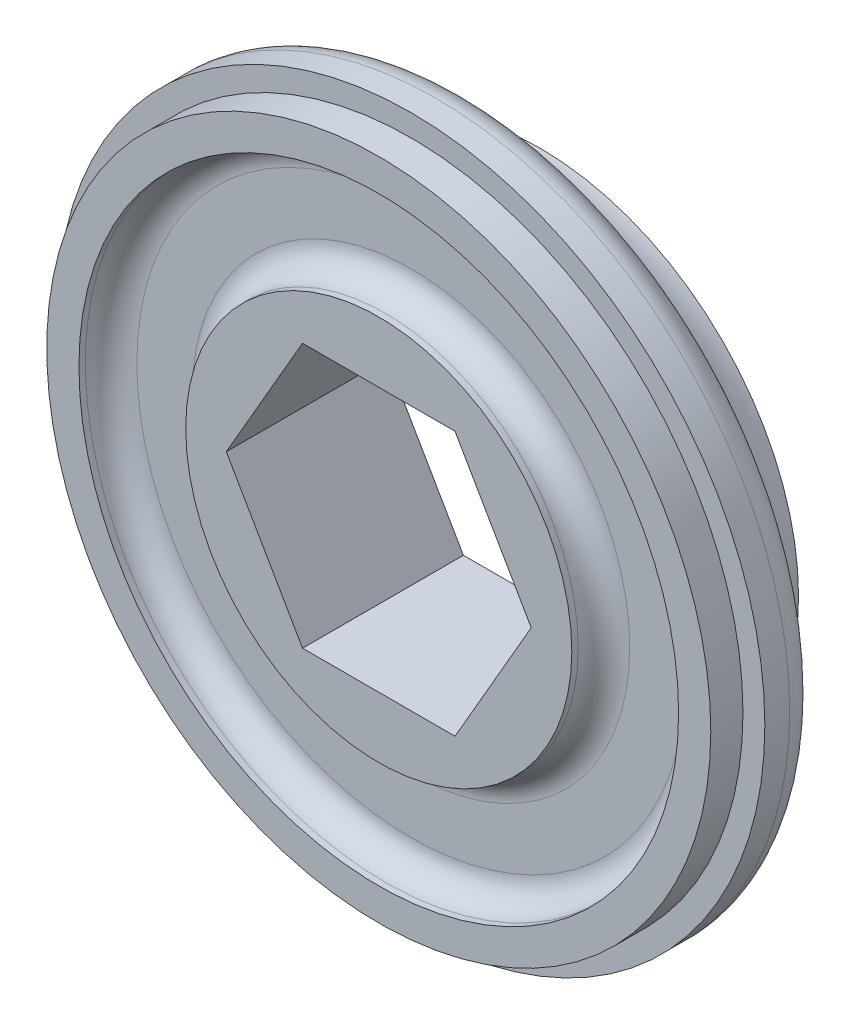
ISO-10303-21;
HEADER;
FILE_DESCRIPTION(('STEP AP214'),'2;1');
FILE_NAME('part.step','',(''),(''),'','','');
FILE_SCHEMA(('AUTOMOTIVE_DESIGN { 1 0 10303 214 1 1 1 1 }'));
ENDSEC;
DATA;
#1=APPLICATION_CONTEXT('core data for automotive mechanical design processes');
#2=APPLICATION_PROTOCOL_DEFINITION('international standard','automotive_design',2000,#1);
#3=PRODUCT_CONTEXT('',#1,'mechanical');
#4=PRODUCT('Part','Part','',(#3));
#5=PRODUCT_RELATED_PRODUCT_CATEGORY('part','',(#4));
#6=PRODUCT_DEFINITION_FORMATION('','',#4);
#7=PRODUCT_DEFINITION_CONTEXT('part definition',#1,'design');
#8=PRODUCT_DEFINITION('design','',#6,#7);
#9=PRODUCT_DEFINITION_SHAPE('','',#8);
#10=(LENGTH_UNIT() NAMED_UNIT(*) SI_UNIT(.MILLI.,.METRE.));
#11=(NAMED_UNIT(*) PLANE_ANGLE_UNIT() SI_UNIT($,.RADIAN.));
#12=(NAMED_UNIT(*) SI_UNIT($,.STERADIAN.) SOLID_ANGLE_UNIT());
#13=UNCERTAINTY_MEASURE_WITH_UNIT(LENGTH_MEASURE(1.E-05),#10,'distance_accuracy_value','');
#14=(GEOMETRIC_REPRESENTATION_CONTEXT(3) GLOBAL_UNCERTAINTY_ASSIGNED_CONTEXT((#13)) GLOBAL_UNIT_ASSIGNED_CONTEXT((#10,
#11,#12)) REPRESENTATION_CONTEXT('',''));
#15=CARTESIAN_POINT('',(0.,0.,0.));
#16=DIRECTION('',(0.,0.,1.));
#17=DIRECTION('',(1.,0.,0.));
#18=AXIS2_PLACEMENT_3D('',#15,#16,#17);
#19=CARTESIAN_POINT('',(-3.76149473879733,6.5151,15.875));
#20=DIRECTION('',(0.866025403784439,-0.5,0.));
#21=DIRECTION('',(0.5,0.866025403784439,0.));
#22=AXIS2_PLACEMENT_3D('',#19,#20,#21);
#23=PLANE('',#22);
#24=DIRECTION('',(0.,0.,-1.));
#25=VECTOR('',#24,1.);
#26=CARTESIAN_POINT('',(-7.52298947759466,0.,15.875));
#27=LINE('',#26,#25);
#28=CARTESIAN_POINT('',(-7.52298947759466,0.,15.875));
#29=VERTEX_POINT('',#28);
#30=CARTESIAN_POINT('',(-7.52298947759466,0.,7.9375));
#31=VERTEX_POINT('',#30);
#32=EDGE_CURVE('E97',#29,#31,#27,.T.);
#33=ORIENTED_EDGE('',*,*,#32,.T.);
#34=DIRECTION('',(0.5,0.866025403784439,0.));
#35=VECTOR('',#34,1.);
#36=CARTESIAN_POINT('',(-3.76149473879733,6.5151,7.9375));
#37=LINE('',#36,#35);
#38=CARTESIAN_POINT('',(-3.76149473879733,6.5151,7.9375));
#39=VERTEX_POINT('',#38);
#40=EDGE_CURVE('E87',#31,#39,#37,.T.);
#41=ORIENTED_EDGE('',*,*,#40,.T.);
#42=DIRECTION('',(0.,0.,-1.));
#43=VECTOR('',#42,1.);
#44=CARTESIAN_POINT('',(-3.76149473879733,6.5151,15.875));
#45=LINE('',#44,#43);
#46=CARTESIAN_POINT('',(-3.76149473879733,6.5151,15.875));
#47=VERTEX_POINT('',#46);
#48=EDGE_CURVE('E94',#47,#39,#45,.T.);
#49=ORIENTED_EDGE('',*,*,#48,.F.);
#50=DIRECTION('',(-0.5,-0.866025403784439,0.));
#51=VECTOR('',#50,1.);
#52=CARTESIAN_POINT('',(-3.76149473879733,6.5151,15.875));
#53=LINE('',#52,#51);
#54=EDGE_CURVE('E124',#47,#29,#53,.T.);
#55=ORIENTED_EDGE('',*,*,#54,.T.);
#56=EDGE_LOOP('',(#33,#41,#49,#55));
#57=FACE_BOUND('',#56,.T.);
#58=ADVANCED_FACE('F32',(#57),#23,.T.);
#59=CARTESIAN_POINT('',(-7.52298947759466,0.,15.875));
#60=DIRECTION('',(0.866025403784439,0.5,0.));
#61=DIRECTION('',(-0.5,0.866025403784439,0.));
#62=AXIS2_PLACEMENT_3D('',#59,#60,#61);
#63=PLANE('',#62);
#64=DIRECTION('',(0.,0.,-1.));
#65=VECTOR('',#64,1.);
#66=CARTESIAN_POINT('',(-3.76149473879733,-6.5151,15.875));
#67=LINE('',#66,#65);
#68=CARTESIAN_POINT('',(-3.76149473879733,-6.5151,15.875));
#69=VERTEX_POINT('',#68);
#70=CARTESIAN_POINT('',(-3.76149473879733,-6.5151,7.9375));
#71=VERTEX_POINT('',#70);
#72=EDGE_CURVE('E116',#69,#71,#67,.T.);
#73=ORIENTED_EDGE('',*,*,#72,.T.);
#74=DIRECTION('',(-0.5,0.866025403784439,0.));
#75=VECTOR('',#74,1.);
#76=CARTESIAN_POINT('',(-7.52298947759466,0.,7.9375));
#77=LINE('',#76,#75);
#78=EDGE_CURVE('E99',#71,#31,#77,.T.);
#79=ORIENTED_EDGE('',*,*,#78,.T.);
#80=ORIENTED_EDGE('',*,*,#32,.F.);
#81=DIRECTION('',(0.5,-0.866025403784439,0.));
#82=VECTOR('',#81,1.);
#83=CARTESIAN_POINT('',(-7.52298947759466,0.,15.875));
#84=LINE('',#83,#82);
#85=EDGE_CURVE('E212',#29,#69,#84,.T.);
#86=ORIENTED_EDGE('',*,*,#85,.T.);
#87=EDGE_LOOP('',(#73,#79,#80,#86));
#88=FACE_BOUND('',#87,.T.);
#89=ADVANCED_FACE('F173',(#88),#63,.T.);
#90=CARTESIAN_POINT('',(-3.76149473879733,-6.5151,15.875));
#91=DIRECTION('',(0.,1.,0.));
#92=DIRECTION('',(-1.,0.,0.));
#93=AXIS2_PLACEMENT_3D('',#90,#91,#92);
#94=PLANE('',#93);
#95=DIRECTION('',(0.,0.,-1.));
#96=VECTOR('',#95,1.);
#97=CARTESIAN_POINT('',(3.76149473879733,-6.5151,15.875));
#98=LINE('',#97,#96);
#99=CARTESIAN_POINT('',(3.76149473879733,-6.5151,15.875));
#100=VERTEX_POINT('',#99);
#101=CARTESIAN_POINT('',(3.76149473879733,-6.5151,7.9375));
#102=VERTEX_POINT('',#101);
#103=EDGE_CURVE('E113',#100,#102,#98,.T.);
#104=ORIENTED_EDGE('',*,*,#103,.T.);
#105=DIRECTION('',(-1.,0.,0.));
#106=VECTOR('',#105,1.);
#107=CARTESIAN_POINT('',(-3.76149473879733,-6.5151,7.9375));
#108=LINE('',#107,#106);
#109=EDGE_CURVE('E228',#102,#71,#108,.T.);
#110=ORIENTED_EDGE('',*,*,#109,.T.);
#111=ORIENTED_EDGE('',*,*,#72,.F.);
#112=DIRECTION('',(1.,0.,0.));
#113=VECTOR('',#112,1.);
#114=CARTESIAN_POINT('',(-3.76149473879733,-6.5151,15.875));
#115=LINE('',#114,#113);
#116=EDGE_CURVE('E214',#69,#100,#115,.T.);
#117=ORIENTED_EDGE('',*,*,#116,.T.);
#118=EDGE_LOOP('',(#104,#110,#111,#117));
#119=FACE_BOUND('',#118,.T.);
#120=ADVANCED_FACE('F178',(#119),#94,.T.);
#121=CARTESIAN_POINT('',(3.76149473879733,-6.5151,15.875));
#122=DIRECTION('',(-0.866025403784439,0.5,0.));
#123=DIRECTION('',(-0.5,-0.866025403784439,0.));
#124=AXIS2_PLACEMENT_3D('',#121,#122,#123);
#125=PLANE('',#124);
#126=DIRECTION('',(0.,0.,-1.));
#127=VECTOR('',#126,1.);
#128=CARTESIAN_POINT('',(7.52298947759466,0.,15.875));
#129=LINE('',#128,#127);
#130=CARTESIAN_POINT('',(7.52298947759466,0.,15.875));
#131=VERTEX_POINT('',#130);
#132=CARTESIAN_POINT('',(7.52298947759466,0.,7.9375));
#133=VERTEX_POINT('',#132);
#134=EDGE_CURVE('E105',#131,#133,#129,.T.);
#135=ORIENTED_EDGE('',*,*,#134,.T.);
#136=DIRECTION('',(-0.5,-0.866025403784439,0.));
#137=VECTOR('',#136,1.);
#138=CARTESIAN_POINT('',(3.76149473879733,-6.5151,7.9375));
#139=LINE('',#138,#137);
#140=EDGE_CURVE('E230',#133,#102,#139,.T.);
#141=ORIENTED_EDGE('',*,*,#140,.T.);
#142=ORIENTED_EDGE('',*,*,#103,.F.);
#143=DIRECTION('',(0.5,0.866025403784439,0.));
#144=VECTOR('',#143,1.);
#145=CARTESIAN_POINT('',(3.76149473879733,-6.5151,15.875));
#146=LINE('',#145,#144);
#147=EDGE_CURVE('E216',#100,#131,#146,.T.);
#148=ORIENTED_EDGE('',*,*,#147,.T.);
#149=EDGE_LOOP('',(#135,#141,#142,#148));
#150=FACE_BOUND('',#149,.T.);
#151=ADVANCED_FACE('F236',(#150),#125,.T.);
#152=CARTESIAN_POINT('',(7.52298947759466,0.,15.875));
#153=DIRECTION('',(-0.866025403784438,-0.5,0.));
#154=DIRECTION('',(0.5,-0.866025403784439,0.));
#155=AXIS2_PLACEMENT_3D('',#152,#153,#154);
#156=PLANE('',#155);
#157=DIRECTION('',(0.,0.,-1.));
#158=VECTOR('',#157,1.);
#159=CARTESIAN_POINT('',(3.76149473879733,6.5151,15.875));
#160=LINE('',#159,#158);
#161=CARTESIAN_POINT('',(3.76149473879733,6.5151,15.875));
#162=VERTEX_POINT('',#161);
#163=CARTESIAN_POINT('',(3.76149473879733,6.5151,7.9375));
#164=VERTEX_POINT('',#163);
#165=EDGE_CURVE('E55',#162,#164,#160,.T.);
#166=ORIENTED_EDGE('',*,*,#165,.T.);
#167=DIRECTION('',(0.5,-0.866025403784439,0.));
#168=VECTOR('',#167,1.);
#169=CARTESIAN_POINT('',(7.52298947759466,0.,7.9375));
#170=LINE('',#169,#168);
#171=EDGE_CURVE('E48',#164,#133,#170,.T.);
#172=ORIENTED_EDGE('',*,*,#171,.T.);
#173=ORIENTED_EDGE('',*,*,#134,.F.);
#174=DIRECTION('',(-0.5,0.866025403784438,0.));
#175=VECTOR('',#174,1.);
#176=CARTESIAN_POINT('',(7.52298947759466,0.,15.875));
#177=LINE('',#176,#175);
#178=EDGE_CURVE('E107',#131,#162,#177,.T.);
#179=ORIENTED_EDGE('',*,*,#178,.T.);
#180=EDGE_LOOP('',(#166,#172,#173,#179));
#181=FACE_BOUND('',#180,.T.);
#182=ADVANCED_FACE('F220',(#181),#156,.T.);
#183=CARTESIAN_POINT('',(3.76149473879733,6.5151,15.875));
#184=DIRECTION('',(0.,-1.,0.));
#185=DIRECTION('',(0.,0.,-1.));
#186=AXIS2_PLACEMENT_3D('',#183,#184,#185);
#187=PLANE('',#186);
#188=ORIENTED_EDGE('',*,*,#48,.T.);
#189=DIRECTION('',(1.,0.,0.));
#190=VECTOR('',#189,1.);
#191=CARTESIAN_POINT('',(3.76149473879733,6.5151,7.9375));
#192=LINE('',#191,#190);
#193=EDGE_CURVE('E83',#39,#164,#192,.T.);
#194=ORIENTED_EDGE('',*,*,#193,.T.);
#195=ORIENTED_EDGE('',*,*,#165,.F.);
#196=DIRECTION('',(-1.,0.,0.));
#197=VECTOR('',#196,1.);
#198=CARTESIAN_POINT('',(3.76149473879733,6.5151,15.875));
#199=LINE('',#198,#197);
#200=EDGE_CURVE('E103',#162,#47,#199,.T.);
#201=ORIENTED_EDGE('',*,*,#200,.T.);
#202=EDGE_LOOP('',(#188,#194,#195,#201));
#203=FACE_BOUND('',#202,.T.);
#204=ADVANCED_FACE('F101',(#203),#187,.T.);
#205=CARTESIAN_POINT('',(0.,0.,7.9375));
#206=DIRECTION('',(0.,0.,1.));
#207=DIRECTION('',(1.,0.,0.));
#208=AXIS2_PLACEMENT_3D('',#205,#206,#207);
#209=TOROIDAL_SURFACE('',#208,16.331738244304,3.556);
#210=CARTESIAN_POINT('',(0.,0.,11.4794522198768));
#211=DIRECTION('',(0.,0.,-1.));
#212=DIRECTION('',(-1.,0.,0.));
#213=AXIS2_PLACEMENT_3D('',#210,#211,#212);
#214=CIRCLE('',#213,16.0159685939211);
#215=CARTESIAN_POINT('',(-16.0159685939211,0.,11.4794522198768));
#216=VERTEX_POINT('',#215);
#217=EDGE_CURVE('E41',#216,#216,#214,.T.);
#218=ORIENTED_EDGE('',*,*,#217,.T.);
#219=EDGE_LOOP('',(#218));
#220=FACE_BOUND('',#219,.T.);
#221=CARTESIAN_POINT('',(0.,0.,7.9375));
#222=DIRECTION('',(0.,0.,1.));
#223=DIRECTION('',(1.,0.,0.));
#224=AXIS2_PLACEMENT_3D('',#221,#222,#223);
#225=CIRCLE('',#224,12.775738244304);
#226=CARTESIAN_POINT('',(12.775738244304,0.,7.9375));
#227=VERTEX_POINT('',#226);
#228=EDGE_CURVE('E36',#227,#227,#225,.T.);
#229=ORIENTED_EDGE('',*,*,#228,.T.);
#230=EDGE_LOOP('',(#229));
#231=FACE_BOUND('',#230,.T.);
#232=ADVANCED_FACE('F140',(#220,#231),#209,.F.);
#233=CARTESIAN_POINT('',(0.,0.,15.875));
#234=DIRECTION('',(0.,0.,1.));
#235=DIRECTION('',(1.,0.,0.));
#236=AXIS2_PLACEMENT_3D('',#233,#234,#235);
#237=PLANE('',#236);
#238=ORIENTED_EDGE('',*,*,#85,.F.);
#239=ORIENTED_EDGE('',*,*,#54,.F.);
#240=ORIENTED_EDGE('',*,*,#200,.F.);
#241=ORIENTED_EDGE('',*,*,#178,.F.);
#242=ORIENTED_EDGE('',*,*,#147,.F.);
#243=ORIENTED_EDGE('',*,*,#116,.F.);
#244=EDGE_LOOP('',(#238,#239,#240,#241,#242,#243));
#245=FACE_BOUND('',#244,.T.);
#246=CARTESIAN_POINT('',(0.,0.,15.875));
#247=DIRECTION('',(0.,0.,-1.));
#248=DIRECTION('',(-1.,0.,0.));
#249=AXIS2_PLACEMENT_3D('',#246,#247,#248);
#250=CIRCLE('',#249,9.525);
#251=CARTESIAN_POINT('',(-9.525,0.,15.875));
#252=VERTEX_POINT('',#251);
#253=EDGE_CURVE('E98',#252,#252,#250,.T.);
#254=ORIENTED_EDGE('',*,*,#253,.F.);
#255=EDGE_LOOP('',(#254));
#256=FACE_BOUND('',#255,.T.);
#257=ADVANCED_FACE('F152',(#245,#256),#237,.T.);
#258=CARTESIAN_POINT('',(0.,0.,15.875));
#259=DIRECTION('',(0.,0.,-1.));
#260=DIRECTION('',(-1.,0.,0.));
#261=AXIS2_PLACEMENT_3D('',#258,#259,#260);
#262=CYLINDRICAL_SURFACE('',#261,17.4625);
#263=CARTESIAN_POINT('',(0.,0.,13.060680889466));
#264=DIRECTION('',(0.,0.,-1.));
#265=DIRECTION('',(-1.,0.,0.));
#266=AXIS2_PLACEMENT_3D('',#263,#264,#265);
#267=CIRCLE('',#266,17.4625);
#268=CARTESIAN_POINT('',(-17.4625,0.,13.060680889466));
#269=VERTEX_POINT('',#268);
#270=EDGE_CURVE('E11',#269,#269,#267,.F.);
#271=ORIENTED_EDGE('',*,*,#270,.T.);
#272=EDGE_LOOP('',(#271));
#273=FACE_BOUND('',#272,.T.);
#274=CARTESIAN_POINT('',(0.,0.,14.2875));
#275=DIRECTION('',(0.,0.,1.));
#276=DIRECTION('',(1.,0.,0.));
#277=AXIS2_PLACEMENT_3D('',#274,#275,#276);
#278=CIRCLE('',#277,17.4625);
#279=CARTESIAN_POINT('',(17.4625,0.,14.2875));
#280=VERTEX_POINT('',#279);
#281=EDGE_CURVE('E121',#280,#280,#278,.T.);
#282=ORIENTED_EDGE('',*,*,#281,.F.);
#283=EDGE_LOOP('',(#282));
#284=FACE_BOUND('',#283,.T.);
#285=ADVANCED_FACE('F148',(#273,#284),#262,.T.);
#286=CARTESIAN_POINT('',(0.,0.,15.875));
#287=DIRECTION('',(0.,0.,-1.));
#288=DIRECTION('',(-1.,0.,0.));
#289=AXIS2_PLACEMENT_3D('',#286,#287,#288);
#290=CIRCLE('',#289,14.7955);
#291=CARTESIAN_POINT('',(-14.7955,0.,15.875));
#292=VERTEX_POINT('',#291);
#293=EDGE_CURVE('E201',#292,#292,#290,.T.);
#294=ORIENTED_EDGE('',*,*,#293,.T.);
#295=EDGE_LOOP('',(#294));
#296=FACE_BOUND('',#295,.T.);
#297=CARTESIAN_POINT('',(0.,0.,15.875));
#298=DIRECTION('',(0.,0.,1.));
#299=DIRECTION('',(1.,0.,0.));
#300=AXIS2_PLACEMENT_3D('',#297,#298,#299);
#301=CIRCLE('',#300,16.383);
#302=CARTESIAN_POINT('',(16.383,0.,15.875));
#303=VERTEX_POINT('',#302);
#304=EDGE_CURVE('E202',#303,#303,#301,.T.);
#305=ORIENTED_EDGE('',*,*,#304,.T.);
#306=EDGE_LOOP('',(#305));
#307=FACE_BOUND('',#306,.T.);
#308=ADVANCED_FACE('F151',(#296,#307),#237,.T.);
#309=CARTESIAN_POINT('',(0.,0.,14.2875));
#310=DIRECTION('',(0.,0.,1.));
#311=DIRECTION('',(1.,0.,0.));
#312=AXIS2_PLACEMENT_3D('',#309,#310,#311);
#313=PLANE('',#312);
#314=CARTESIAN_POINT('',(0.,0.,14.2875));
#315=DIRECTION('',(0.,0.,1.));
#316=DIRECTION('',(1.,0.,0.));
#317=AXIS2_PLACEMENT_3D('',#314,#315,#316);
#318=CIRCLE('',#317,16.383);
#319=CARTESIAN_POINT('',(16.383,0.,14.2875));
#320=VERTEX_POINT('',#319);
#321=EDGE_CURVE('E125',#320,#320,#318,.T.);
#322=ORIENTED_EDGE('',*,*,#321,.F.);
#323=EDGE_LOOP('',(#322));
#324=FACE_BOUND('',#323,.T.);
#325=ORIENTED_EDGE('',*,*,#281,.T.);
#326=EDGE_LOOP('',(#325));
#327=FACE_BOUND('',#326,.T.);
#328=ADVANCED_FACE('F156',(#324,#327),#313,.T.);
#329=CARTESIAN_POINT('',(0.,0.,14.2875));
#330=DIRECTION('',(0.,0.,1.));
#331=DIRECTION('',(1.,0.,0.));
#332=AXIS2_PLACEMENT_3D('',#329,#330,#331);
#333=CYLINDRICAL_SURFACE('',#332,16.383);
#334=ORIENTED_EDGE('',*,*,#321,.T.);
#335=EDGE_LOOP('',(#334));
#336=FACE_BOUND('',#335,.T.);
#337=ORIENTED_EDGE('',*,*,#304,.F.);
#338=EDGE_LOOP('',(#337));
#339=FACE_BOUND('',#338,.T.);
#340=ADVANCED_FACE('F158',(#336,#339),#333,.T.);
#341=CARTESIAN_POINT('',(0.,0.,14.2875));
#342=DIRECTION('',(0.,0.,1.));
#343=DIRECTION('',(-1.,0.,0.));
#344=AXIS2_PLACEMENT_3D('',#341,#342,#343);
#345=PLANE('',#344);
#346=CARTESIAN_POINT('',(0.,0.,14.2875));
#347=DIRECTION('',(0.,0.,1.));
#348=DIRECTION('',(1.,0.,0.));
#349=AXIS2_PLACEMENT_3D('',#346,#347,#348);
#350=CIRCLE('',#349,10.795);
#351=CARTESIAN_POINT('',(10.795,0.,14.2875));
#352=VERTEX_POINT('',#351);
#353=EDGE_CURVE('E128',#352,#352,#350,.F.);
#354=ORIENTED_EDGE('',*,*,#353,.T.);
#355=EDGE_LOOP('',(#354));
#356=FACE_BOUND('',#355,.T.);
#357=CARTESIAN_POINT('',(0.,0.,14.2875));
#358=DIRECTION('',(0.,0.,1.));
#359=DIRECTION('',(1.,0.,0.));
#360=AXIS2_PLACEMENT_3D('',#357,#358,#359);
#361=CIRCLE('',#360,13.5255);
#362=CARTESIAN_POINT('',(13.5255,0.,14.2875));
#363=VERTEX_POINT('',#362);
#364=EDGE_CURVE('E120',#363,#363,#361,.T.);
#365=ORIENTED_EDGE('',*,*,#364,.T.);
#366=EDGE_LOOP('',(#365));
#367=FACE_BOUND('',#366,.T.);
#368=ADVANCED_FACE('F165',(#356,#367),#345,.T.);
#369=CARTESIAN_POINT('',(0.,0.,14.2875));
#370=DIRECTION('',(0.,0.,1.));
#371=DIRECTION('',(1.,0.,0.));
#372=AXIS2_PLACEMENT_3D('',#369,#370,#371);
#373=CYLINDRICAL_SURFACE('',#372,14.7955);
#374=CARTESIAN_POINT('',(0.,0.,15.5575));
#375=DIRECTION('',(0.,0.,1.));
#376=DIRECTION('',(1.,0.,0.));
#377=AXIS2_PLACEMENT_3D('',#374,#375,#376);
#378=CIRCLE('',#377,14.7955);
#379=CARTESIAN_POINT('',(14.7955,0.,15.5575));
#380=VERTEX_POINT('',#379);
#381=EDGE_CURVE('E134',#380,#380,#378,.F.);
#382=ORIENTED_EDGE('',*,*,#381,.T.);
#383=EDGE_LOOP('',(#382));
#384=FACE_BOUND('',#383,.T.);
#385=ORIENTED_EDGE('',*,*,#293,.F.);
#386=EDGE_LOOP('',(#385));
#387=FACE_BOUND('',#386,.T.);
#388=ADVANCED_FACE('F195',(#384,#387),#373,.F.);
#389=CARTESIAN_POINT('',(0.,0.,14.2875));
#390=DIRECTION('',(0.,0.,1.));
#391=DIRECTION('',(1.,0.,0.));
#392=AXIS2_PLACEMENT_3D('',#389,#390,#391);
#393=CYLINDRICAL_SURFACE('',#392,9.525);
#394=CARTESIAN_POINT('',(0.,0.,15.5575));
#395=DIRECTION('',(0.,0.,1.));
#396=DIRECTION('',(1.,0.,0.));
#397=AXIS2_PLACEMENT_3D('',#394,#395,#396);
#398=CIRCLE('',#397,9.525);
#399=CARTESIAN_POINT('',(9.525,0.,15.5575));
#400=VERTEX_POINT('',#399);
#401=EDGE_CURVE('E131',#400,#400,#398,.T.);
#402=ORIENTED_EDGE('',*,*,#401,.T.);
#403=EDGE_LOOP('',(#402));
#404=FACE_BOUND('',#403,.T.);
#405=ORIENTED_EDGE('',*,*,#253,.T.);
#406=EDGE_LOOP('',(#405));
#407=FACE_BOUND('',#406,.T.);
#408=ADVANCED_FACE('F185',(#404,#407),#393,.T.);
#409=CARTESIAN_POINT('',(0.,0.,15.5575));
#410=DIRECTION('',(0.,0.,1.));
#411=DIRECTION('',(1.,0.,0.));
#412=AXIS2_PLACEMENT_3D('',#409,#410,#411);
#413=TOROIDAL_SURFACE('',#412,10.795,1.27);
#414=ORIENTED_EDGE('',*,*,#401,.F.);
#415=EDGE_LOOP('',(#414));
#416=FACE_BOUND('',#415,.T.);
#417=ORIENTED_EDGE('',*,*,#353,.F.);
#418=EDGE_LOOP('',(#417));
#419=FACE_BOUND('',#418,.T.);
#420=ADVANCED_FACE('F183',(#416,#419),#413,.F.);
#421=CARTESIAN_POINT('',(0.,0.,15.5575));
#422=DIRECTION('',(0.,0.,1.));
#423=DIRECTION('',(1.,0.,0.));
#424=AXIS2_PLACEMENT_3D('',#421,#422,#423);
#425=TOROIDAL_SURFACE('',#424,13.5255,1.27);
#426=ORIENTED_EDGE('',*,*,#364,.F.);
#427=EDGE_LOOP('',(#426));
#428=FACE_BOUND('',#427,.T.);
#429=ORIENTED_EDGE('',*,*,#381,.F.);
#430=EDGE_LOOP('',(#429));
#431=FACE_BOUND('',#430,.T.);
#432=ADVANCED_FACE('F145',(#428,#431),#425,.F.);
#433=CARTESIAN_POINT('',(0.,0.,13.060680889466));
#434=DIRECTION('',(0.,0.,-1.));
#435=DIRECTION('',(-1.,0.,0.));
#436=AXIS2_PLACEMENT_3D('',#433,#434,#435);
#437=TOROIDAL_SURFACE('',#436,15.875,1.5875);
#438=ORIENTED_EDGE('',*,*,#217,.F.);
#439=EDGE_LOOP('',(#438));
#440=FACE_BOUND('',#439,.T.);
#441=ORIENTED_EDGE('',*,*,#270,.F.);
#442=EDGE_LOOP('',(#441));
#443=FACE_BOUND('',#442,.T.);
#444=ADVANCED_FACE('F34',(#440,#443),#437,.T.);
#445=CARTESIAN_POINT('',(0.,0.,7.9375));
#446=DIRECTION('',(0.,0.,-1.));
#447=DIRECTION('',(-1.,0.,0.));
#448=AXIS2_PLACEMENT_3D('',#445,#446,#447);
#449=PLANE('',#448);
#450=ORIENTED_EDGE('',*,*,#78,.F.);
#451=ORIENTED_EDGE('',*,*,#109,.F.);
#452=ORIENTED_EDGE('',*,*,#140,.F.);
#453=ORIENTED_EDGE('',*,*,#171,.F.);
#454=ORIENTED_EDGE('',*,*,#193,.F.);
#455=ORIENTED_EDGE('',*,*,#40,.F.);
#456=EDGE_LOOP('',(#450,#451,#452,#453,#454,#455));
#457=FACE_BOUND('',#456,.T.);
#458=ORIENTED_EDGE('',*,*,#228,.F.);
#459=EDGE_LOOP('',(#458));
#460=FACE_BOUND('',#459,.T.);
#461=ADVANCED_FACE('F85',(#457,#460),#449,.T.);
#462=CLOSED_SHELL('',(#58,#89,#120,#151,#182,#204,#232,#257,#285,#308,#328,#340,#368,#388,#408,
#420,#432,#444,#461));
#463=MANIFOLD_SOLID_BREP('B2',#462);
#464=ADVANCED_BREP_SHAPE_REPRESENTATION('',(#18,#463),#14);
#465=SHAPE_DEFINITION_REPRESENTATION(#9,#464);
ENDSEC;
END-ISO-10303-21;
